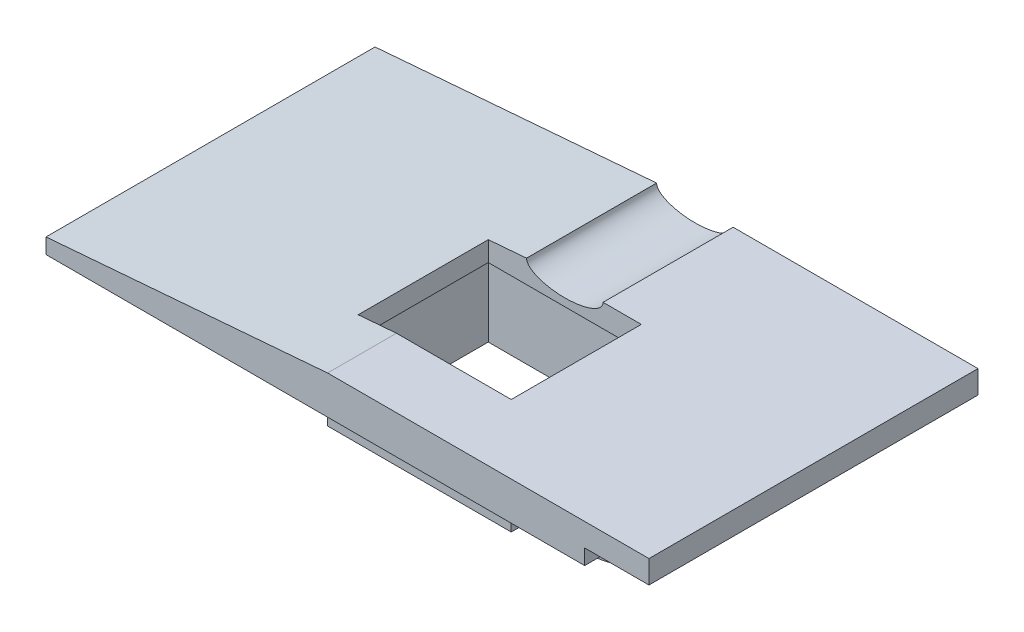
ISO-10303-21;
HEADER;
FILE_DESCRIPTION(('STEP AP214'),'2;1');
FILE_NAME('part.step','',(''),(''),'','','');
FILE_SCHEMA(('AUTOMOTIVE_DESIGN { 1 0 10303 214 1 1 1 1 }'));
ENDSEC;
DATA;
#1=APPLICATION_CONTEXT('core data for automotive mechanical design processes');
#2=APPLICATION_PROTOCOL_DEFINITION('international standard','automotive_design',2000,#1);
#3=PRODUCT_CONTEXT('',#1,'mechanical');
#4=PRODUCT('Part','Part','',(#3));
#5=PRODUCT_RELATED_PRODUCT_CATEGORY('part','',(#4));
#6=PRODUCT_DEFINITION_FORMATION('','',#4);
#7=PRODUCT_DEFINITION_CONTEXT('part definition',#1,'design');
#8=PRODUCT_DEFINITION('design','',#6,#7);
#9=PRODUCT_DEFINITION_SHAPE('','',#8);
#10=(LENGTH_UNIT() NAMED_UNIT(*) SI_UNIT(.MILLI.,.METRE.));
#11=(NAMED_UNIT(*) PLANE_ANGLE_UNIT() SI_UNIT($,.RADIAN.));
#12=(NAMED_UNIT(*) SI_UNIT($,.STERADIAN.) SOLID_ANGLE_UNIT());
#13=UNCERTAINTY_MEASURE_WITH_UNIT(LENGTH_MEASURE(1.E-05),#10,'distance_accuracy_value','');
#14=(GEOMETRIC_REPRESENTATION_CONTEXT(3) GLOBAL_UNCERTAINTY_ASSIGNED_CONTEXT((#13)) GLOBAL_UNIT_ASSIGNED_CONTEXT((#10,
#11,#12)) REPRESENTATION_CONTEXT('',''));
#15=CARTESIAN_POINT('',(0.,0.,0.));
#16=DIRECTION('',(0.,0.,1.));
#17=DIRECTION('',(1.,0.,0.));
#18=AXIS2_PLACEMENT_3D('',#15,#16,#17);
#19=CARTESIAN_POINT('',(0.661018711018712,-1.33076923076924,7.5));
#20=DIRECTION('',(-1.,0.,0.));
#21=DIRECTION('',(0.,0.,1.));
#22=AXIS2_PLACEMENT_3D('',#19,#20,#21);
#23=PLANE('',#22);
#24=DIRECTION('',(0.,1.,0.));
#25=VECTOR('',#24,1.);
#26=CARTESIAN_POINT('',(0.661018711018713,-2.33076923076924,13.2908326913196));
#27=LINE('',#26,#25);
#28=CARTESIAN_POINT('',(0.661018711018713,2.66923076923077,13.2908326913196));
#29=VERTEX_POINT('',#28);
#30=CARTESIAN_POINT('',(0.661018711018713,-1.33076923076924,13.2908326913196));
#31=VERTEX_POINT('',#30);
#32=EDGE_CURVE('E57',#29,#31,#27,.F.);
#33=ORIENTED_EDGE('',*,*,#32,.F.);
#34=DIRECTION('',(0.,0.,1.));
#35=VECTOR('',#34,1.);
#36=CARTESIAN_POINT('',(0.661018711018712,2.66923076923077,7.5));
#37=LINE('',#36,#35);
#38=CARTESIAN_POINT('',(0.661018711018713,2.66923076923077,18.));
#39=VERTEX_POINT('',#38);
#40=EDGE_CURVE('E209',#29,#39,#37,.T.);
#41=ORIENTED_EDGE('',*,*,#40,.T.);
#42=DIRECTION('',(0.,1.,0.));
#43=VECTOR('',#42,1.);
#44=CARTESIAN_POINT('',(0.661018711018714,-1.33076923076924,18.));
#45=LINE('',#44,#43);
#46=CARTESIAN_POINT('',(0.661018711018714,-1.33076923076924,18.));
#47=VERTEX_POINT('',#46);
#48=EDGE_CURVE('E232',#47,#39,#45,.T.);
#49=ORIENTED_EDGE('',*,*,#48,.F.);
#50=DIRECTION('',(0.,0.,1.));
#51=VECTOR('',#50,1.);
#52=CARTESIAN_POINT('',(0.661018711018712,-1.33076923076924,7.5));
#53=LINE('',#52,#51);
#54=EDGE_CURVE('E211',#31,#47,#53,.T.);
#55=ORIENTED_EDGE('',*,*,#54,.F.);
#56=EDGE_LOOP('',(#33,#41,#49,#55));
#57=FACE_BOUND('',#56,.T.);
#58=ADVANCED_FACE('F41',(#57),#23,.F.);
#59=DIRECTION('',(0.,1.,0.));
#60=VECTOR('',#59,1.);
#61=CARTESIAN_POINT('',(0.661018711018713,-2.33076923076924,12.2091673086804));
#62=LINE('',#61,#60);
#63=CARTESIAN_POINT('',(0.661018711018713,-1.33076923076924,12.2091673086804));
#64=VERTEX_POINT('',#63);
#65=CARTESIAN_POINT('',(0.661018711018712,2.66923076923077,12.2091673086804));
#66=VERTEX_POINT('',#65);
#67=EDGE_CURVE('E197',#64,#66,#62,.T.);
#68=ORIENTED_EDGE('',*,*,#67,.F.);
#69=CARTESIAN_POINT('',(0.661018711018712,-1.33076923076924,7.5));
#70=VERTEX_POINT('',#69);
#71=EDGE_CURVE('E236',#70,#64,#53,.T.);
#72=ORIENTED_EDGE('',*,*,#71,.F.);
#73=DIRECTION('',(0.,1.,0.));
#74=VECTOR('',#73,1.);
#75=CARTESIAN_POINT('',(0.661018711018712,-1.33076923076924,7.5));
#76=LINE('',#75,#74);
#77=CARTESIAN_POINT('',(0.661018711018712,2.66923076923077,7.5));
#78=VERTEX_POINT('',#77);
#79=EDGE_CURVE('E235',#70,#78,#76,.T.);
#80=ORIENTED_EDGE('',*,*,#79,.T.);
#81=EDGE_CURVE('E221',#78,#66,#37,.T.);
#82=ORIENTED_EDGE('',*,*,#81,.T.);
#83=EDGE_LOOP('',(#68,#72,#80,#82));
#84=FACE_BOUND('',#83,.T.);
#85=ADVANCED_FACE('F322',(#84),#23,.F.);
#86=CARTESIAN_POINT('',(-5.33898128898128,2.66923076923076,8.5));
#87=DIRECTION('',(0.,0.,-1.));
#88=DIRECTION('',(-1.,0.,0.));
#89=AXIS2_PLACEMENT_3D('',#86,#87,#88);
#90=PLANE('',#89);
#91=DIRECTION('',(-1.,0.,0.));
#92=VECTOR('',#91,1.);
#93=CARTESIAN_POINT('',(-5.33898128898128,3.66923076923076,8.5));
#94=LINE('',#93,#92);
#95=CARTESIAN_POINT('',(-0.338981288981282,3.66923076923077,8.5));
#96=VERTEX_POINT('',#95);
#97=CARTESIAN_POINT('',(-10.3389812889813,3.66923076923076,8.5));
#98=VERTEX_POINT('',#97);
#99=EDGE_CURVE('E64',#96,#98,#94,.T.);
#100=ORIENTED_EDGE('',*,*,#99,.F.);
#101=DIRECTION('',(0.,1.,0.));
#102=VECTOR('',#101,1.);
#103=CARTESIAN_POINT('',(-0.338981288981282,2.66923076923076,8.5));
#104=LINE('',#103,#102);
#105=CARTESIAN_POINT('',(-0.338981288981282,5.16923076923077,8.5));
#106=VERTEX_POINT('',#105);
#107=EDGE_CURVE('E258',#96,#106,#104,.T.);
#108=ORIENTED_EDGE('',*,*,#107,.T.);
#109=DIRECTION('',(-1.,0.,0.));
#110=VECTOR('',#109,1.);
#111=CARTESIAN_POINT('',(-5.33898128898128,5.16923076923077,8.5));
#112=LINE('',#111,#110);
#113=CARTESIAN_POINT('',(-2.83898128898128,5.16923076923077,8.5));
#114=VERTEX_POINT('',#113);
#115=EDGE_CURVE('E246',#106,#114,#112,.T.);
#116=ORIENTED_EDGE('',*,*,#115,.T.);
#117=CARTESIAN_POINT('',(-5.33898128898128,5.16923076923077,8.5));
#118=DIRECTION('',(0.,0.,-1.));
#119=DIRECTION('',(-1.,0.,0.));
#120=AXIS2_PLACEMENT_3D('',#117,#118,#119);
#121=ELLIPSE('',#120,2.5,1.);
#122=CARTESIAN_POINT('',(-7.83898128898129,5.16923076923077,8.5));
#123=VERTEX_POINT('',#122);
#124=EDGE_CURVE('E365',#114,#123,#121,.T.);
#125=ORIENTED_EDGE('',*,*,#124,.T.);
#126=DIRECTION('',(-0.996693574295642,-0.08125219355671,0.));
#127=VECTOR('',#126,1.);
#128=CARTESIAN_POINT('',(-26.2389812889813,3.66923076923077,8.5));
#129=LINE('',#128,#127);
#130=CARTESIAN_POINT('',(-10.3389812889813,4.96542642140468,8.5));
#131=VERTEX_POINT('',#130);
#132=EDGE_CURVE('E261',#123,#131,#129,.T.);
#133=ORIENTED_EDGE('',*,*,#132,.T.);
#134=DIRECTION('',(0.,1.,0.));
#135=VECTOR('',#134,1.);
#136=CARTESIAN_POINT('',(-10.3389812889813,2.66923076923076,8.5));
#137=LINE('',#136,#135);
#138=EDGE_CURVE('E257',#98,#131,#137,.T.);
#139=ORIENTED_EDGE('',*,*,#138,.F.);
#140=EDGE_LOOP('',(#100,#108,#116,#125,#133,#139));
#141=FACE_BOUND('',#140,.T.);
#142=ADVANCED_FACE('F287',(#141),#90,.F.);
#143=CARTESIAN_POINT('',(-0.338981288981282,2.66923076923076,17.));
#144=DIRECTION('',(1.,0.,0.));
#145=DIRECTION('',(0.,0.,-1.));
#146=AXIS2_PLACEMENT_3D('',#143,#144,#145);
#147=PLANE('',#146);
#148=DIRECTION('',(0.,0.,-1.));
#149=VECTOR('',#148,1.);
#150=CARTESIAN_POINT('',(-0.338981288981282,3.66923076923077,17.));
#151=LINE('',#150,#149);
#152=CARTESIAN_POINT('',(-0.338981288981282,3.66923076923076,17.));
#153=VERTEX_POINT('',#152);
#154=EDGE_CURVE('E490',#153,#96,#151,.T.);
#155=ORIENTED_EDGE('',*,*,#154,.F.);
#156=DIRECTION('',(0.,1.,0.));
#157=VECTOR('',#156,1.);
#158=CARTESIAN_POINT('',(-0.338981288981282,2.66923076923076,17.));
#159=LINE('',#158,#157);
#160=CARTESIAN_POINT('',(-0.338981288981282,5.16923076923077,17.));
#161=VERTEX_POINT('',#160);
#162=EDGE_CURVE('E262',#153,#161,#159,.T.);
#163=ORIENTED_EDGE('',*,*,#162,.T.);
#164=DIRECTION('',(0.,0.,-1.));
#165=VECTOR('',#164,1.);
#166=CARTESIAN_POINT('',(-0.338981288981282,5.16923076923077,17.));
#167=LINE('',#166,#165);
#168=EDGE_CURVE('E253',#161,#106,#167,.T.);
#169=ORIENTED_EDGE('',*,*,#168,.T.);
#170=ORIENTED_EDGE('',*,*,#107,.F.);
#171=EDGE_LOOP('',(#155,#163,#169,#170));
#172=FACE_BOUND('',#171,.T.);
#173=ADVANCED_FACE('F343',(#172),#147,.F.);
#174=CARTESIAN_POINT('',(-10.3389812889813,2.66923076923076,17.));
#175=DIRECTION('',(0.,0.,1.));
#176=DIRECTION('',(1.,0.,0.));
#177=AXIS2_PLACEMENT_3D('',#174,#175,#176);
#178=PLANE('',#177);
#179=DIRECTION('',(1.,0.,0.));
#180=VECTOR('',#179,1.);
#181=CARTESIAN_POINT('',(-10.3389812889813,3.66923076923076,17.));
#182=LINE('',#181,#180);
#183=CARTESIAN_POINT('',(-10.3389812889813,3.66923076923076,17.));
#184=VERTEX_POINT('',#183);
#185=EDGE_CURVE('E487',#184,#153,#182,.T.);
#186=ORIENTED_EDGE('',*,*,#185,.F.);
#187=DIRECTION('',(0.,1.,0.));
#188=VECTOR('',#187,1.);
#189=CARTESIAN_POINT('',(-10.3389812889813,2.66923076923076,17.));
#190=LINE('',#189,#188);
#191=CARTESIAN_POINT('',(-10.3389812889813,4.96542642140468,17.));
#192=VERTEX_POINT('',#191);
#193=EDGE_CURVE('E265',#184,#192,#190,.T.);
#194=ORIENTED_EDGE('',*,*,#193,.T.);
#195=DIRECTION('',(0.996693574295642,0.08125219355671,0.));
#196=VECTOR('',#195,1.);
#197=CARTESIAN_POINT('',(-26.2389812889813,3.66923076923077,17.));
#198=LINE('',#197,#196);
#199=CARTESIAN_POINT('',(-7.83898128898129,5.16923076923077,17.));
#200=VERTEX_POINT('',#199);
#201=EDGE_CURVE('E359',#192,#200,#198,.T.);
#202=ORIENTED_EDGE('',*,*,#201,.T.);
#203=DIRECTION('',(1.,0.,0.));
#204=VECTOR('',#203,1.);
#205=CARTESIAN_POINT('',(-10.3389812889813,5.16923076923077,17.));
#206=LINE('',#205,#204);
#207=EDGE_CURVE('E249',#200,#161,#206,.T.);
#208=ORIENTED_EDGE('',*,*,#207,.T.);
#209=ORIENTED_EDGE('',*,*,#162,.F.);
#210=EDGE_LOOP('',(#186,#194,#202,#208,#209));
#211=FACE_BOUND('',#210,.T.);
#212=ADVANCED_FACE('F346',(#211),#178,.F.);
#213=CARTESIAN_POINT('',(-10.3389812889813,2.66923076923076,8.5));
#214=DIRECTION('',(-1.,0.,0.));
#215=DIRECTION('',(0.,0.,1.));
#216=AXIS2_PLACEMENT_3D('',#213,#214,#215);
#217=PLANE('',#216);
#218=DIRECTION('',(0.,0.,1.));
#219=VECTOR('',#218,1.);
#220=CARTESIAN_POINT('',(-10.3389812889813,3.66923076923076,8.5));
#221=LINE('',#220,#219);
#222=EDGE_CURVE('E50',#98,#184,#221,.T.);
#223=ORIENTED_EDGE('',*,*,#222,.F.);
#224=ORIENTED_EDGE('',*,*,#138,.T.);
#225=DIRECTION('',(0.,0.,1.));
#226=VECTOR('',#225,1.);
#227=CARTESIAN_POINT('',(-10.3389812889813,4.96542642140468,21.5));
#228=LINE('',#227,#226);
#229=EDGE_CURVE('E368',#131,#192,#228,.T.);
#230=ORIENTED_EDGE('',*,*,#229,.T.);
#231=ORIENTED_EDGE('',*,*,#193,.F.);
#232=EDGE_LOOP('',(#223,#224,#230,#231));
#233=FACE_BOUND('',#232,.T.);
#234=ADVANCED_FACE('F299',(#233),#217,.F.);
#235=CARTESIAN_POINT('',(8.96101871101872,2.66923076923077,21.5));
#236=DIRECTION('',(0.,-1.,0.));
#237=DIRECTION('',(1.,0.,0.));
#238=AXIS2_PLACEMENT_3D('',#235,#236,#237);
#239=PLANE('',#238);
#240=CARTESIAN_POINT('',(-14.2489812889813,2.66923076923076,12.75));
#241=DIRECTION('',(0.,-1.,0.));
#242=DIRECTION('',(1.,0.,0.));
#243=AXIS2_PLACEMENT_3D('',#240,#241,#242);
#244=CIRCLE('',#243,2.9);
#245=CARTESIAN_POINT('',(-11.3489812889813,2.66923076923076,12.75));
#246=VERTEX_POINT('',#245);
#247=EDGE_CURVE('E596',#246,#246,#244,.T.);
#248=ORIENTED_EDGE('',*,*,#247,.F.);
#249=EDGE_LOOP('',(#248));
#250=FACE_BOUND('',#249,.T.);
#251=DIRECTION('',(-1.,0.,0.));
#252=VECTOR('',#251,1.);
#253=CARTESIAN_POINT('',(8.96101871101872,2.66923076923077,0.));
#254=LINE('',#253,#252);
#255=CARTESIAN_POINT('',(8.96101871101872,2.66923076923077,0.));
#256=VERTEX_POINT('',#255);
#257=CARTESIAN_POINT('',(-26.2389812889813,2.66923076923076,0.));
#258=VERTEX_POINT('',#257);
#259=EDGE_CURVE('E408',#256,#258,#254,.T.);
#260=ORIENTED_EDGE('',*,*,#259,.F.);
#261=DIRECTION('',(0.,0.,-1.));
#262=VECTOR('',#261,1.);
#263=CARTESIAN_POINT('',(8.96101871101872,2.66923076923077,21.5));
#264=LINE('',#263,#262);
#265=CARTESIAN_POINT('',(8.96101871101872,2.66923076923077,21.5));
#266=VERTEX_POINT('',#265);
#267=EDGE_CURVE('E376',#266,#256,#264,.T.);
#268=ORIENTED_EDGE('',*,*,#267,.F.);
#269=DIRECTION('',(-1.,0.,0.));
#270=VECTOR('',#269,1.);
#271=CARTESIAN_POINT('',(8.96101871101872,2.66923076923077,21.5));
#272=LINE('',#271,#270);
#273=CARTESIAN_POINT('',(-26.2389812889813,2.66923076923076,21.5));
#274=VERTEX_POINT('',#273);
#275=EDGE_CURVE('E436',#266,#274,#272,.T.);
#276=ORIENTED_EDGE('',*,*,#275,.T.);
#277=DIRECTION('',(0.,0.,-1.));
#278=VECTOR('',#277,1.);
#279=CARTESIAN_POINT('',(-26.2389812889813,2.66923076923076,21.5));
#280=LINE('',#279,#278);
#281=EDGE_CURVE('E371',#274,#258,#280,.T.);
#282=ORIENTED_EDGE('',*,*,#281,.T.);
#283=EDGE_LOOP('',(#260,#268,#276,#282));
#284=FACE_BOUND('',#283,.T.);
#285=ORIENTED_EDGE('',*,*,#40,.F.);
#286=CARTESIAN_POINT('',(3.56101871101871,2.66923076923077,12.75));
#287=DIRECTION('',(0.,-1.,0.));
#288=DIRECTION('',(1.,0.,0.));
#289=AXIS2_PLACEMENT_3D('',#286,#287,#288);
#290=CIRCLE('',#289,2.95);
#291=EDGE_CURVE('E194',#66,#29,#290,.T.);
#292=ORIENTED_EDGE('',*,*,#291,.F.);
#293=ORIENTED_EDGE('',*,*,#81,.F.);
#294=DIRECTION('',(1.,0.,0.));
#295=VECTOR('',#294,1.);
#296=CARTESIAN_POINT('',(-11.3389812889813,2.66923076923076,7.5));
#297=LINE('',#296,#295);
#298=CARTESIAN_POINT('',(-11.3389812889813,2.66923076923076,7.5));
#299=VERTEX_POINT('',#298);
#300=EDGE_CURVE('E222',#299,#78,#297,.T.);
#301=ORIENTED_EDGE('',*,*,#300,.F.);
#302=DIRECTION('',(0.,0.,-1.));
#303=VECTOR('',#302,1.);
#304=CARTESIAN_POINT('',(-11.3389812889813,2.66923076923076,18.));
#305=LINE('',#304,#303);
#306=CARTESIAN_POINT('',(-11.3389812889813,2.66923076923076,18.));
#307=VERTEX_POINT('',#306);
#308=EDGE_CURVE('E228',#307,#299,#305,.T.);
#309=ORIENTED_EDGE('',*,*,#308,.F.);
#310=DIRECTION('',(-1.,0.,0.));
#311=VECTOR('',#310,1.);
#312=CARTESIAN_POINT('',(0.661018711018713,2.66923076923077,18.));
#313=LINE('',#312,#311);
#314=EDGE_CURVE('E219',#39,#307,#313,.T.);
#315=ORIENTED_EDGE('',*,*,#314,.F.);
#316=EDGE_LOOP('',(#285,#292,#293,#301,#309,#315));
#317=FACE_BOUND('',#316,.T.);
#318=ADVANCED_FACE('F216',(#250,#284,#317),#239,.T.);
#319=CARTESIAN_POINT('',(-26.2389812889813,2.66923076923076,21.5));
#320=DIRECTION('',(-1.,0.,0.));
#321=DIRECTION('',(0.,0.,1.));
#322=AXIS2_PLACEMENT_3D('',#319,#320,#321);
#323=PLANE('',#322);
#324=DIRECTION('',(0.,1.,0.));
#325=VECTOR('',#324,1.);
#326=CARTESIAN_POINT('',(-26.2389812889813,2.66923076923076,0.));
#327=LINE('',#326,#325);
#328=CARTESIAN_POINT('',(-26.2389812889813,3.66923076923077,0.));
#329=VERTEX_POINT('',#328);
#330=EDGE_CURVE('E432',#258,#329,#327,.T.);
#331=ORIENTED_EDGE('',*,*,#330,.F.);
#332=ORIENTED_EDGE('',*,*,#281,.F.);
#333=DIRECTION('',(0.,1.,0.));
#334=VECTOR('',#333,1.);
#335=CARTESIAN_POINT('',(-26.2389812889813,2.66923076923076,21.5));
#336=LINE('',#335,#334);
#337=CARTESIAN_POINT('',(-26.2389812889813,3.66923076923077,21.5));
#338=VERTEX_POINT('',#337);
#339=EDGE_CURVE('E412',#274,#338,#336,.T.);
#340=ORIENTED_EDGE('',*,*,#339,.T.);
#341=DIRECTION('',(0.,0.,-1.));
#342=VECTOR('',#341,1.);
#343=CARTESIAN_POINT('',(-26.2389812889813,3.66923076923077,21.5));
#344=LINE('',#343,#342);
#345=EDGE_CURVE('E394',#338,#329,#344,.T.);
#346=ORIENTED_EDGE('',*,*,#345,.T.);
#347=EDGE_LOOP('',(#331,#332,#340,#346));
#348=FACE_BOUND('',#347,.T.);
#349=ADVANCED_FACE('F43',(#348),#323,.T.);
#350=CARTESIAN_POINT('',(8.96101871101872,3.66923076923077,21.5));
#351=DIRECTION('',(1.,0.,0.));
#352=DIRECTION('',(0.,0.,-1.));
#353=AXIS2_PLACEMENT_3D('',#350,#351,#352);
#354=PLANE('',#353);
#355=DIRECTION('',(0.,-1.,0.));
#356=VECTOR('',#355,1.);
#357=CARTESIAN_POINT('',(8.96101871101872,3.66923076923077,0.));
#358=LINE('',#357,#356);
#359=CARTESIAN_POINT('',(8.96101871101872,3.66923076923077,0.));
#360=VERTEX_POINT('',#359);
#361=EDGE_CURVE('E413',#360,#256,#358,.T.);
#362=ORIENTED_EDGE('',*,*,#361,.F.);
#363=DIRECTION('',(0.,0.,-1.));
#364=VECTOR('',#363,1.);
#365=CARTESIAN_POINT('',(8.96101871101872,3.66923076923077,21.5));
#366=LINE('',#365,#364);
#367=CARTESIAN_POINT('',(8.96101871101872,3.66923076923077,21.5));
#368=VERTEX_POINT('',#367);
#369=EDGE_CURVE('E403',#368,#360,#366,.T.);
#370=ORIENTED_EDGE('',*,*,#369,.F.);
#371=DIRECTION('',(0.,-1.,0.));
#372=VECTOR('',#371,1.);
#373=CARTESIAN_POINT('',(8.96101871101872,3.66923076923077,21.5));
#374=LINE('',#373,#372);
#375=EDGE_CURVE('E440',#368,#266,#374,.T.);
#376=ORIENTED_EDGE('',*,*,#375,.T.);
#377=ORIENTED_EDGE('',*,*,#267,.T.);
#378=EDGE_LOOP('',(#362,#370,#376,#377));
#379=FACE_BOUND('',#378,.T.);
#380=ADVANCED_FACE('F301',(#379),#354,.T.);
#381=CARTESIAN_POINT('',(13.1610187110187,3.66923076923077,21.5));
#382=DIRECTION('',(0.,-1.,0.));
#383=DIRECTION('',(0.,0.,-1.));
#384=AXIS2_PLACEMENT_3D('',#381,#382,#383);
#385=PLANE('',#384);
#386=DIRECTION('',(-1.,0.,0.));
#387=VECTOR('',#386,1.);
#388=CARTESIAN_POINT('',(13.1610187110187,3.66923076923077,0.));
#389=LINE('',#388,#387);
#390=CARTESIAN_POINT('',(13.1610187110187,3.66923076923077,0.));
#391=VERTEX_POINT('',#390);
#392=EDGE_CURVE('E417',#391,#360,#389,.T.);
#393=ORIENTED_EDGE('',*,*,#392,.F.);
#394=DIRECTION('',(0.,0.,-1.));
#395=VECTOR('',#394,1.);
#396=CARTESIAN_POINT('',(13.1610187110187,3.66923076923077,21.5));
#397=LINE('',#396,#395);
#398=CARTESIAN_POINT('',(13.1610187110187,3.66923076923077,21.5));
#399=VERTEX_POINT('',#398);
#400=EDGE_CURVE('E400',#399,#391,#397,.T.);
#401=ORIENTED_EDGE('',*,*,#400,.F.);
#402=DIRECTION('',(-1.,0.,0.));
#403=VECTOR('',#402,1.);
#404=CARTESIAN_POINT('',(13.1610187110187,3.66923076923077,21.5));
#405=LINE('',#404,#403);
#406=EDGE_CURVE('E444',#399,#368,#405,.T.);
#407=ORIENTED_EDGE('',*,*,#406,.T.);
#408=ORIENTED_EDGE('',*,*,#369,.T.);
#409=EDGE_LOOP('',(#393,#401,#407,#408));
#410=FACE_BOUND('',#409,.T.);
#411=ADVANCED_FACE('F304',(#410),#385,.T.);
#412=CARTESIAN_POINT('',(13.1610187110187,5.16923076923077,21.5));
#413=DIRECTION('',(1.,0.,0.));
#414=DIRECTION('',(0.,0.,-1.));
#415=AXIS2_PLACEMENT_3D('',#412,#413,#414);
#416=PLANE('',#415);
#417=DIRECTION('',(0.,-1.,0.));
#418=VECTOR('',#417,1.);
#419=CARTESIAN_POINT('',(13.1610187110187,5.16923076923077,0.));
#420=LINE('',#419,#418);
#421=CARTESIAN_POINT('',(13.1610187110187,5.16923076923077,0.));
#422=VERTEX_POINT('',#421);
#423=EDGE_CURVE('E421',#422,#391,#420,.T.);
#424=ORIENTED_EDGE('',*,*,#423,.F.);
#425=DIRECTION('',(0.,0.,-1.));
#426=VECTOR('',#425,1.);
#427=CARTESIAN_POINT('',(13.1610187110187,5.16923076923077,21.5));
#428=LINE('',#427,#426);
#429=CARTESIAN_POINT('',(13.1610187110187,5.16923076923077,21.5));
#430=VERTEX_POINT('',#429);
#431=EDGE_CURVE('E393',#430,#422,#428,.T.);
#432=ORIENTED_EDGE('',*,*,#431,.F.);
#433=DIRECTION('',(0.,-1.,0.));
#434=VECTOR('',#433,1.);
#435=CARTESIAN_POINT('',(13.1610187110187,5.16923076923077,21.5));
#436=LINE('',#435,#434);
#437=EDGE_CURVE('E448',#430,#399,#436,.T.);
#438=ORIENTED_EDGE('',*,*,#437,.T.);
#439=ORIENTED_EDGE('',*,*,#400,.T.);
#440=EDGE_LOOP('',(#424,#432,#438,#439));
#441=FACE_BOUND('',#440,.T.);
#442=ADVANCED_FACE('F308',(#441),#416,.T.);
#443=CARTESIAN_POINT('',(-7.83898128898129,5.16923076923077,21.5));
#444=DIRECTION('',(0.,1.,0.));
#445=DIRECTION('',(0.,0.,1.));
#446=AXIS2_PLACEMENT_3D('',#443,#444,#445);
#447=PLANE('',#446);
#448=ORIENTED_EDGE('',*,*,#207,.F.);
#449=DIRECTION('',(0.,0.,-1.));
#450=VECTOR('',#449,1.);
#451=CARTESIAN_POINT('',(-7.83898128898129,5.16923076923077,21.5));
#452=LINE('',#451,#450);
#453=CARTESIAN_POINT('',(-7.83898128898129,5.16923076923077,21.5));
#454=VERTEX_POINT('',#453);
#455=EDGE_CURVE('E389',#454,#200,#452,.T.);
#456=ORIENTED_EDGE('',*,*,#455,.F.);
#457=DIRECTION('',(1.,0.,0.));
#458=VECTOR('',#457,1.);
#459=CARTESIAN_POINT('',(-7.83898128898129,5.16923076923077,21.5));
#460=LINE('',#459,#458);
#461=EDGE_CURVE('E452',#454,#430,#460,.T.);
#462=ORIENTED_EDGE('',*,*,#461,.T.);
#463=ORIENTED_EDGE('',*,*,#431,.T.);
#464=DIRECTION('',(1.,0.,0.));
#465=VECTOR('',#464,1.);
#466=CARTESIAN_POINT('',(-7.83898128898129,5.16923076923077,0.));
#467=LINE('',#466,#465);
#468=CARTESIAN_POINT('',(-2.83898128898128,5.16923076923077,0.));
#469=VERTEX_POINT('',#468);
#470=EDGE_CURVE('E425',#469,#422,#467,.T.);
#471=ORIENTED_EDGE('',*,*,#470,.F.);
#472=DIRECTION('',(0.,0.,-1.));
#473=VECTOR('',#472,1.);
#474=CARTESIAN_POINT('',(-2.83898128898128,5.16923076923077,8.5));
#475=LINE('',#474,#473);
#476=EDGE_CURVE('E388',#114,#469,#475,.T.);
#477=ORIENTED_EDGE('',*,*,#476,.F.);
#478=ORIENTED_EDGE('',*,*,#115,.F.);
#479=ORIENTED_EDGE('',*,*,#168,.F.);
#480=EDGE_LOOP('',(#448,#456,#462,#463,#471,#477,#478,#479));
#481=FACE_BOUND('',#480,.T.);
#482=ADVANCED_FACE('F312',(#481),#447,.T.);
#483=CARTESIAN_POINT('',(-26.2389812889813,3.66923076923077,21.5));
#484=DIRECTION('',(-0.08125219355671,0.996693574295642,0.));
#485=DIRECTION('',(-0.996693574295642,-0.08125219355671,0.));
#486=AXIS2_PLACEMENT_3D('',#483,#484,#485);
#487=PLANE('',#486);
#488=ORIENTED_EDGE('',*,*,#201,.F.);
#489=ORIENTED_EDGE('',*,*,#229,.F.);
#490=ORIENTED_EDGE('',*,*,#132,.F.);
#491=DIRECTION('',(0.,0.,-1.));
#492=VECTOR('',#491,1.);
#493=CARTESIAN_POINT('',(-7.83898128898129,5.16923076923077,8.5));
#494=LINE('',#493,#492);
#495=CARTESIAN_POINT('',(-7.83898128898129,5.16923076923077,0.));
#496=VERTEX_POINT('',#495);
#497=EDGE_CURVE('E383',#123,#496,#494,.T.);
#498=ORIENTED_EDGE('',*,*,#497,.T.);
#499=DIRECTION('',(0.996693574295642,0.08125219355671,0.));
#500=VECTOR('',#499,1.);
#501=CARTESIAN_POINT('',(-26.2389812889813,3.66923076923077,0.));
#502=LINE('',#501,#500);
#503=EDGE_CURVE('E428',#329,#496,#502,.T.);
#504=ORIENTED_EDGE('',*,*,#503,.F.);
#505=ORIENTED_EDGE('',*,*,#345,.F.);
#506=DIRECTION('',(0.996693574295642,0.08125219355671,0.));
#507=VECTOR('',#506,1.);
#508=CARTESIAN_POINT('',(-26.2389812889813,3.66923076923077,21.5));
#509=LINE('',#508,#507);
#510=EDGE_CURVE('E456',#338,#454,#509,.T.);
#511=ORIENTED_EDGE('',*,*,#510,.T.);
#512=ORIENTED_EDGE('',*,*,#455,.T.);
#513=EDGE_LOOP('',(#488,#489,#490,#498,#504,#505,#511,#512));
#514=FACE_BOUND('',#513,.T.);
#515=ADVANCED_FACE('F292',(#514),#487,.T.);
#516=CARTESIAN_POINT('',(0.,0.,21.5));
#517=DIRECTION('',(0.,0.,-1.));
#518=DIRECTION('',(-1.,0.,0.));
#519=AXIS2_PLACEMENT_3D('',#516,#517,#518);
#520=PLANE('',#519);
#521=ORIENTED_EDGE('',*,*,#339,.F.);
#522=ORIENTED_EDGE('',*,*,#275,.F.);
#523=ORIENTED_EDGE('',*,*,#375,.F.);
#524=ORIENTED_EDGE('',*,*,#406,.F.);
#525=ORIENTED_EDGE('',*,*,#437,.F.);
#526=ORIENTED_EDGE('',*,*,#461,.F.);
#527=ORIENTED_EDGE('',*,*,#510,.F.);
#528=EDGE_LOOP('',(#521,#522,#523,#524,#525,#526,#527));
#529=FACE_BOUND('',#528,.T.);
#530=ADVANCED_FACE('F289',(#529),#520,.F.);
#531=CARTESIAN_POINT('',(0.,0.,0.));
#532=DIRECTION('',(0.,0.,-1.));
#533=DIRECTION('',(-1.,0.,0.));
#534=AXIS2_PLACEMENT_3D('',#531,#532,#533);
#535=PLANE('',#534);
#536=CARTESIAN_POINT('',(-5.33898128898128,5.16923076923077,0.));
#537=DIRECTION('',(0.,0.,-1.));
#538=DIRECTION('',(1.,0.,0.));
#539=AXIS2_PLACEMENT_3D('',#536,#537,#538);
#540=ELLIPSE('',#539,2.5,1.);
#541=EDGE_CURVE('E273',#469,#496,#540,.T.);
#542=ORIENTED_EDGE('',*,*,#541,.F.);
#543=ORIENTED_EDGE('',*,*,#470,.T.);
#544=ORIENTED_EDGE('',*,*,#423,.T.);
#545=ORIENTED_EDGE('',*,*,#392,.T.);
#546=ORIENTED_EDGE('',*,*,#361,.T.);
#547=ORIENTED_EDGE('',*,*,#259,.T.);
#548=ORIENTED_EDGE('',*,*,#330,.T.);
#549=ORIENTED_EDGE('',*,*,#503,.T.);
#550=EDGE_LOOP('',(#542,#543,#544,#545,#546,#547,#548,#549));
#551=FACE_BOUND('',#550,.T.);
#552=ADVANCED_FACE('F285',(#551),#535,.T.);
#553=CARTESIAN_POINT('',(-5.33898128898128,5.16923076923077,8.5));
#554=DIRECTION('',(0.,0.,-1.));
#555=DIRECTION('',(1.,0.,0.));
#556=AXIS2_PLACEMENT_3D('',#553,#554,#555);
#557=ELLIPSE('',#556,2.5,1.);
#558=DIRECTION('',(0.,0.,-1.));
#559=VECTOR('',#558,1.);
#560=SURFACE_OF_LINEAR_EXTRUSION('',#557,#559);
#561=ORIENTED_EDGE('',*,*,#541,.T.);
#562=ORIENTED_EDGE('',*,*,#497,.F.);
#563=ORIENTED_EDGE('',*,*,#124,.F.);
#564=ORIENTED_EDGE('',*,*,#476,.T.);
#565=EDGE_LOOP('',(#561,#562,#563,#564));
#566=FACE_BOUND('',#565,.T.);
#567=ADVANCED_FACE('F280',(#566),#560,.F.);
#568=CARTESIAN_POINT('',(0.661018711018714,-1.33076923076924,18.));
#569=DIRECTION('',(0.,0.,-1.));
#570=DIRECTION('',(-1.,0.,0.));
#571=AXIS2_PLACEMENT_3D('',#568,#569,#570);
#572=PLANE('',#571);
#573=ORIENTED_EDGE('',*,*,#314,.T.);
#574=DIRECTION('',(0.,1.,0.));
#575=VECTOR('',#574,1.);
#576=CARTESIAN_POINT('',(-11.3389812889813,-1.33076923076924,18.));
#577=LINE('',#576,#575);
#578=CARTESIAN_POINT('',(-11.3389812889813,-1.33076923076924,18.));
#579=VERTEX_POINT('',#578);
#580=EDGE_CURVE('E243',#579,#307,#577,.T.);
#581=ORIENTED_EDGE('',*,*,#580,.F.);
#582=DIRECTION('',(-1.,0.,0.));
#583=VECTOR('',#582,1.);
#584=CARTESIAN_POINT('',(0.661018711018714,-1.33076923076924,18.));
#585=LINE('',#584,#583);
#586=EDGE_CURVE('E226',#47,#579,#585,.T.);
#587=ORIENTED_EDGE('',*,*,#586,.F.);
#588=ORIENTED_EDGE('',*,*,#48,.T.);
#589=EDGE_LOOP('',(#573,#581,#587,#588));
#590=FACE_BOUND('',#589,.T.);
#591=ADVANCED_FACE('F284',(#590),#572,.F.);
#592=CARTESIAN_POINT('',(-11.3389812889813,-1.33076923076924,18.));
#593=DIRECTION('',(1.,0.,0.));
#594=DIRECTION('',(0.,0.,-1.));
#595=AXIS2_PLACEMENT_3D('',#592,#593,#594);
#596=PLANE('',#595);
#597=ORIENTED_EDGE('',*,*,#308,.T.);
#598=DIRECTION('',(0.,1.,0.));
#599=VECTOR('',#598,1.);
#600=CARTESIAN_POINT('',(-11.3389812889813,-1.33076923076924,7.5));
#601=LINE('',#600,#599);
#602=CARTESIAN_POINT('',(-11.3389812889813,-1.33076923076924,7.5));
#603=VERTEX_POINT('',#602);
#604=EDGE_CURVE('E239',#603,#299,#601,.T.);
#605=ORIENTED_EDGE('',*,*,#604,.F.);
#606=DIRECTION('',(0.,0.,-1.));
#607=VECTOR('',#606,1.);
#608=CARTESIAN_POINT('',(-11.3389812889813,-1.33076923076924,18.));
#609=LINE('',#608,#607);
#610=EDGE_CURVE('E507',#579,#603,#609,.T.);
#611=ORIENTED_EDGE('',*,*,#610,.F.);
#612=ORIENTED_EDGE('',*,*,#580,.T.);
#613=EDGE_LOOP('',(#597,#605,#611,#612));
#614=FACE_BOUND('',#613,.T.);
#615=ADVANCED_FACE('F335',(#614),#596,.F.);
#616=CARTESIAN_POINT('',(-11.3389812889813,-1.33076923076924,7.5));
#617=DIRECTION('',(0.,0.,1.));
#618=DIRECTION('',(1.,0.,0.));
#619=AXIS2_PLACEMENT_3D('',#616,#617,#618);
#620=PLANE('',#619);
#621=ORIENTED_EDGE('',*,*,#300,.T.);
#622=ORIENTED_EDGE('',*,*,#79,.F.);
#623=DIRECTION('',(1.,0.,0.));
#624=VECTOR('',#623,1.);
#625=CARTESIAN_POINT('',(-11.3389812889813,-1.33076923076924,7.5));
#626=LINE('',#625,#624);
#627=EDGE_CURVE('E510',#603,#70,#626,.T.);
#628=ORIENTED_EDGE('',*,*,#627,.F.);
#629=ORIENTED_EDGE('',*,*,#604,.T.);
#630=EDGE_LOOP('',(#621,#622,#628,#629));
#631=FACE_BOUND('',#630,.T.);
#632=ADVANCED_FACE('F332',(#631),#620,.F.);
#633=CARTESIAN_POINT('',(0.,-1.33076923076924,0.));
#634=DIRECTION('',(0.,-1.,0.));
#635=DIRECTION('',(1.,0.,0.));
#636=AXIS2_PLACEMENT_3D('',#633,#634,#635);
#637=PLANE('',#636);
#638=DIRECTION('',(0.,0.,1.));
#639=VECTOR('',#638,1.);
#640=CARTESIAN_POINT('',(0.161018711018712,-1.33076923076924,8.));
#641=LINE('',#640,#639);
#642=CARTESIAN_POINT('',(0.161018711018712,-1.33076923076924,8.));
#643=VERTEX_POINT('',#642);
#644=CARTESIAN_POINT('',(0.161018711018714,-1.33076923076924,17.5));
#645=VERTEX_POINT('',#644);
#646=EDGE_CURVE('E213',#643,#645,#641,.T.);
#647=ORIENTED_EDGE('',*,*,#646,.F.);
#648=DIRECTION('',(1.,0.,0.));
#649=VECTOR('',#648,1.);
#650=CARTESIAN_POINT('',(-10.8389812889813,-1.33076923076924,8.));
#651=LINE('',#650,#649);
#652=CARTESIAN_POINT('',(-10.8389812889813,-1.33076923076924,8.));
#653=VERTEX_POINT('',#652);
#654=EDGE_CURVE('E541',#653,#643,#651,.T.);
#655=ORIENTED_EDGE('',*,*,#654,.F.);
#656=DIRECTION('',(0.,0.,-1.));
#657=VECTOR('',#656,1.);
#658=CARTESIAN_POINT('',(-10.8389812889813,-1.33076923076924,17.5));
#659=LINE('',#658,#657);
#660=CARTESIAN_POINT('',(-10.8389812889813,-1.33076923076924,17.5));
#661=VERTEX_POINT('',#660);
#662=EDGE_CURVE('E549',#661,#653,#659,.T.);
#663=ORIENTED_EDGE('',*,*,#662,.F.);
#664=DIRECTION('',(-1.,0.,0.));
#665=VECTOR('',#664,1.);
#666=CARTESIAN_POINT('',(0.161018711018714,-1.33076923076924,17.5));
#667=LINE('',#666,#665);
#668=EDGE_CURVE('E543',#645,#661,#667,.T.);
#669=ORIENTED_EDGE('',*,*,#668,.F.);
#670=EDGE_LOOP('',(#647,#655,#663,#669));
#671=FACE_BOUND('',#670,.T.);
#672=ORIENTED_EDGE('',*,*,#71,.T.);
#673=CARTESIAN_POINT('',(3.56101871101871,-1.33076923076923,12.75));
#674=DIRECTION('',(0.,-1.,0.));
#675=DIRECTION('',(1.,0.,0.));
#676=AXIS2_PLACEMENT_3D('',#673,#674,#675);
#677=CIRCLE('',#676,2.95);
#678=EDGE_CURVE('E11',#64,#31,#677,.F.);
#679=ORIENTED_EDGE('',*,*,#678,.T.);
#680=ORIENTED_EDGE('',*,*,#54,.T.);
#681=ORIENTED_EDGE('',*,*,#586,.T.);
#682=ORIENTED_EDGE('',*,*,#610,.T.);
#683=ORIENTED_EDGE('',*,*,#627,.T.);
#684=EDGE_LOOP('',(#672,#679,#680,#681,#682,#683));
#685=FACE_BOUND('',#684,.T.);
#686=ADVANCED_FACE('F330',(#671,#685),#637,.T.);
#687=CARTESIAN_POINT('',(0.,3.66923076923077,0.));
#688=DIRECTION('',(0.,-1.,0.));
#689=DIRECTION('',(1.,0.,0.));
#690=AXIS2_PLACEMENT_3D('',#687,#688,#689);
#691=PLANE('',#690);
#692=DIRECTION('',(0.,0.,1.));
#693=VECTOR('',#692,1.);
#694=CARTESIAN_POINT('',(0.161018711018712,3.66923076923077,8.));
#695=LINE('',#694,#693);
#696=CARTESIAN_POINT('',(0.161018711018712,3.66923076923077,8.));
#697=VERTEX_POINT('',#696);
#698=CARTESIAN_POINT('',(0.161018711018713,3.66923076923077,17.5));
#699=VERTEX_POINT('',#698);
#700=EDGE_CURVE('E559',#697,#699,#695,.T.);
#701=ORIENTED_EDGE('',*,*,#700,.T.);
#702=DIRECTION('',(-1.,0.,0.));
#703=VECTOR('',#702,1.);
#704=CARTESIAN_POINT('',(0.161018711018713,3.66923076923077,17.5));
#705=LINE('',#704,#703);
#706=CARTESIAN_POINT('',(-10.8389812889813,3.66923076923076,17.5));
#707=VERTEX_POINT('',#706);
#708=EDGE_CURVE('E576',#699,#707,#705,.T.);
#709=ORIENTED_EDGE('',*,*,#708,.T.);
#710=DIRECTION('',(0.,0.,-1.));
#711=VECTOR('',#710,1.);
#712=CARTESIAN_POINT('',(-10.8389812889813,3.66923076923076,17.5));
#713=LINE('',#712,#711);
#714=CARTESIAN_POINT('',(-10.8389812889813,3.66923076923076,8.));
#715=VERTEX_POINT('',#714);
#716=EDGE_CURVE('E571',#707,#715,#713,.T.);
#717=ORIENTED_EDGE('',*,*,#716,.T.);
#718=DIRECTION('',(1.,0.,0.));
#719=VECTOR('',#718,1.);
#720=CARTESIAN_POINT('',(-10.8389812889813,3.66923076923076,8.));
#721=LINE('',#720,#719);
#722=EDGE_CURVE('E552',#715,#697,#721,.T.);
#723=ORIENTED_EDGE('',*,*,#722,.T.);
#724=EDGE_LOOP('',(#701,#709,#717,#723));
#725=FACE_BOUND('',#724,.T.);
#726=ORIENTED_EDGE('',*,*,#99,.T.);
#727=ORIENTED_EDGE('',*,*,#222,.T.);
#728=ORIENTED_EDGE('',*,*,#185,.T.);
#729=ORIENTED_EDGE('',*,*,#154,.T.);
#730=EDGE_LOOP('',(#726,#727,#728,#729));
#731=FACE_BOUND('',#730,.T.);
#732=ADVANCED_FACE('F528',(#725,#731),#691,.T.);
#733=CARTESIAN_POINT('',(0.161018711018712,3.66923076923077,8.));
#734=DIRECTION('',(1.,0.,0.));
#735=DIRECTION('',(0.,1.,0.));
#736=AXIS2_PLACEMENT_3D('',#733,#734,#735);
#737=PLANE('',#736);
#738=ORIENTED_EDGE('',*,*,#646,.T.);
#739=DIRECTION('',(0.,-1.,0.));
#740=VECTOR('',#739,1.);
#741=CARTESIAN_POINT('',(0.161018711018713,3.66923076923077,17.5));
#742=LINE('',#741,#740);
#743=EDGE_CURVE('E499',#699,#645,#742,.T.);
#744=ORIENTED_EDGE('',*,*,#743,.F.);
#745=ORIENTED_EDGE('',*,*,#700,.F.);
#746=DIRECTION('',(0.,-1.,0.));
#747=VECTOR('',#746,1.);
#748=CARTESIAN_POINT('',(0.161018711018712,3.66923076923077,8.));
#749=LINE('',#748,#747);
#750=EDGE_CURVE('E491',#697,#643,#749,.T.);
#751=ORIENTED_EDGE('',*,*,#750,.T.);
#752=EDGE_LOOP('',(#738,#744,#745,#751));
#753=FACE_BOUND('',#752,.T.);
#754=ADVANCED_FACE('F533',(#753),#737,.F.);
#755=CARTESIAN_POINT('',(-10.8389812889813,3.66923076923076,8.));
#756=DIRECTION('',(0.,0.,-1.));
#757=DIRECTION('',(0.,1.,0.));
#758=AXIS2_PLACEMENT_3D('',#755,#756,#757);
#759=PLANE('',#758);
#760=ORIENTED_EDGE('',*,*,#654,.T.);
#761=ORIENTED_EDGE('',*,*,#750,.F.);
#762=ORIENTED_EDGE('',*,*,#722,.F.);
#763=DIRECTION('',(0.,-1.,0.));
#764=VECTOR('',#763,1.);
#765=CARTESIAN_POINT('',(-10.8389812889813,3.66923076923076,8.));
#766=LINE('',#765,#764);
#767=EDGE_CURVE('E496',#715,#653,#766,.T.);
#768=ORIENTED_EDGE('',*,*,#767,.T.);
#769=EDGE_LOOP('',(#760,#761,#762,#768));
#770=FACE_BOUND('',#769,.T.);
#771=ADVANCED_FACE('F650',(#770),#759,.F.);
#772=CARTESIAN_POINT('',(-10.8389812889813,3.66923076923076,17.5));
#773=DIRECTION('',(-1.,0.,0.));
#774=DIRECTION('',(0.,0.,1.));
#775=AXIS2_PLACEMENT_3D('',#772,#773,#774);
#776=PLANE('',#775);
#777=ORIENTED_EDGE('',*,*,#662,.T.);
#778=ORIENTED_EDGE('',*,*,#767,.F.);
#779=ORIENTED_EDGE('',*,*,#716,.F.);
#780=DIRECTION('',(0.,-1.,0.));
#781=VECTOR('',#780,1.);
#782=CARTESIAN_POINT('',(-10.8389812889813,3.66923076923076,17.5));
#783=LINE('',#782,#781);
#784=EDGE_CURVE('E562',#707,#661,#783,.T.);
#785=ORIENTED_EDGE('',*,*,#784,.T.);
#786=EDGE_LOOP('',(#777,#778,#779,#785));
#787=FACE_BOUND('',#786,.T.);
#788=ADVANCED_FACE('F653',(#787),#776,.F.);
#789=CARTESIAN_POINT('',(0.161018711018713,3.66923076923077,17.5));
#790=DIRECTION('',(0.,0.,1.));
#791=DIRECTION('',(0.,-1.,0.));
#792=AXIS2_PLACEMENT_3D('',#789,#790,#791);
#793=PLANE('',#792);
#794=ORIENTED_EDGE('',*,*,#668,.T.);
#795=ORIENTED_EDGE('',*,*,#784,.F.);
#796=ORIENTED_EDGE('',*,*,#708,.F.);
#797=ORIENTED_EDGE('',*,*,#743,.T.);
#798=EDGE_LOOP('',(#794,#795,#796,#797));
#799=FACE_BOUND('',#798,.T.);
#800=ADVANCED_FACE('F647',(#799),#793,.F.);
#801=CARTESIAN_POINT('',(3.56101871101871,-2.33076923076923,12.75));
#802=DIRECTION('',(0.,1.,0.));
#803=DIRECTION('',(-1.,0.,0.));
#804=AXIS2_PLACEMENT_3D('',#801,#802,#803);
#805=CYLINDRICAL_SURFACE('',#804,2.95);
#806=CARTESIAN_POINT('',(3.56101871101871,-2.33076923076923,12.75));
#807=DIRECTION('',(0.,-1.,0.));
#808=DIRECTION('',(1.,0.,0.));
#809=AXIS2_PLACEMENT_3D('',#806,#807,#808);
#810=CIRCLE('',#809,2.95);
#811=CARTESIAN_POINT('',(6.51101871101871,-2.33076923076923,12.75));
#812=VERTEX_POINT('',#811);
#813=EDGE_CURVE('E203',#812,#812,#810,.T.);
#814=ORIENTED_EDGE('',*,*,#813,.F.);
#815=EDGE_LOOP('',(#814));
#816=FACE_BOUND('',#815,.T.);
#817=ORIENTED_EDGE('',*,*,#291,.T.);
#818=ORIENTED_EDGE('',*,*,#32,.T.);
#819=ORIENTED_EDGE('',*,*,#678,.F.);
#820=ORIENTED_EDGE('',*,*,#67,.T.);
#821=EDGE_LOOP('',(#817,#818,#819,#820));
#822=FACE_BOUND('',#821,.T.);
#823=ADVANCED_FACE('F195',(#816,#822),#805,.T.);
#824=CARTESIAN_POINT('',(3.56101871101871,-2.33076923076923,12.75));
#825=DIRECTION('',(0.,-1.,0.));
#826=DIRECTION('',(1.,0.,0.));
#827=AXIS2_PLACEMENT_3D('',#824,#825,#826);
#828=PLANE('',#827);
#829=CARTESIAN_POINT('',(3.56101871101871,-2.33076923076923,12.75));
#830=DIRECTION('',(0.,-1.,0.));
#831=DIRECTION('',(1.,0.,0.));
#832=AXIS2_PLACEMENT_3D('',#829,#830,#831);
#833=CIRCLE('',#832,0.950000000000001);
#834=CARTESIAN_POINT('',(4.51101871101871,-2.33076923076923,12.75));
#835=VERTEX_POINT('',#834);
#836=EDGE_CURVE('E588',#835,#835,#833,.T.);
#837=ORIENTED_EDGE('',*,*,#836,.F.);
#838=EDGE_LOOP('',(#837));
#839=FACE_BOUND('',#838,.T.);
#840=ORIENTED_EDGE('',*,*,#813,.T.);
#841=EDGE_LOOP('',(#840));
#842=FACE_BOUND('',#841,.T.);
#843=ADVANCED_FACE('F641',(#839,#842),#828,.T.);
#844=CARTESIAN_POINT('',(3.56101871101871,3.16923076923077,12.75));
#845=DIRECTION('',(0.,-1.,0.));
#846=DIRECTION('',(1.,0.,0.));
#847=AXIS2_PLACEMENT_3D('',#844,#845,#846);
#848=CYLINDRICAL_SURFACE('',#847,0.950000000000001);
#849=CARTESIAN_POINT('',(3.56101871101871,3.16923076923077,12.75));
#850=DIRECTION('',(0.,-1.,0.));
#851=DIRECTION('',(1.,0.,0.));
#852=AXIS2_PLACEMENT_3D('',#849,#850,#851);
#853=CIRCLE('',#852,0.950000000000001);
#854=CARTESIAN_POINT('',(4.51101871101871,3.16923076923077,12.75));
#855=VERTEX_POINT('',#854);
#856=EDGE_CURVE('E204',#855,#855,#853,.T.);
#857=ORIENTED_EDGE('',*,*,#856,.F.);
#858=EDGE_LOOP('',(#857));
#859=FACE_BOUND('',#858,.T.);
#860=ORIENTED_EDGE('',*,*,#836,.T.);
#861=EDGE_LOOP('',(#860));
#862=FACE_BOUND('',#861,.T.);
#863=ADVANCED_FACE('F635',(#859,#862),#848,.F.);
#864=CARTESIAN_POINT('',(3.56101871101871,3.16923076923077,12.75));
#865=DIRECTION('',(0.,-1.,0.));
#866=DIRECTION('',(1.,0.,0.));
#867=AXIS2_PLACEMENT_3D('',#864,#865,#866);
#868=PLANE('',#867);
#869=ORIENTED_EDGE('',*,*,#856,.T.);
#870=EDGE_LOOP('',(#869));
#871=FACE_BOUND('',#870,.T.);
#872=ADVANCED_FACE('F629',(#871),#868,.T.);
#873=CARTESIAN_POINT('',(-14.2489812889813,-2.33076923076924,12.75));
#874=DIRECTION('',(0.,1.,0.));
#875=DIRECTION('',(-1.,0.,0.));
#876=AXIS2_PLACEMENT_3D('',#873,#874,#875);
#877=CYLINDRICAL_SURFACE('',#876,2.9);
#878=CARTESIAN_POINT('',(-14.2489812889813,-2.33076923076924,12.75));
#879=DIRECTION('',(0.,-1.,0.));
#880=DIRECTION('',(1.,0.,0.));
#881=AXIS2_PLACEMENT_3D('',#878,#879,#880);
#882=CIRCLE('',#881,2.9);
#883=CARTESIAN_POINT('',(-11.3489812889813,-2.33076923076924,12.75));
#884=VERTEX_POINT('',#883);
#885=EDGE_CURVE('E592',#884,#884,#882,.T.);
#886=ORIENTED_EDGE('',*,*,#885,.F.);
#887=EDGE_LOOP('',(#886));
#888=FACE_BOUND('',#887,.T.);
#889=ORIENTED_EDGE('',*,*,#247,.T.);
#890=EDGE_LOOP('',(#889));
#891=FACE_BOUND('',#890,.T.);
#892=ADVANCED_FACE('F623',(#888,#891),#877,.T.);
#893=CARTESIAN_POINT('',(-14.2489812889813,-2.33076923076924,12.75));
#894=DIRECTION('',(0.,-1.,0.));
#895=DIRECTION('',(1.,0.,0.));
#896=AXIS2_PLACEMENT_3D('',#893,#894,#895);
#897=PLANE('',#896);
#898=CARTESIAN_POINT('',(-14.2489812889813,-2.33076923076924,12.75));
#899=DIRECTION('',(0.,-1.,0.));
#900=DIRECTION('',(1.,0.,0.));
#901=AXIS2_PLACEMENT_3D('',#898,#899,#900);
#902=CIRCLE('',#901,0.9);
#903=CARTESIAN_POINT('',(-13.3489812889813,-2.33076923076924,12.75));
#904=VERTEX_POINT('',#903);
#905=EDGE_CURVE('E604',#904,#904,#902,.T.);
#906=ORIENTED_EDGE('',*,*,#905,.F.);
#907=EDGE_LOOP('',(#906));
#908=FACE_BOUND('',#907,.T.);
#909=ORIENTED_EDGE('',*,*,#885,.T.);
#910=EDGE_LOOP('',(#909));
#911=FACE_BOUND('',#910,.T.);
#912=ADVANCED_FACE('F617',(#908,#911),#897,.T.);
#913=CARTESIAN_POINT('',(-14.2489812889813,3.16923076923076,12.75));
#914=DIRECTION('',(0.,-1.,0.));
#915=DIRECTION('',(1.,0.,0.));
#916=AXIS2_PLACEMENT_3D('',#913,#914,#915);
#917=CYLINDRICAL_SURFACE('',#916,0.9);
#918=CARTESIAN_POINT('',(-14.2489812889813,3.16923076923076,12.75));
#919=DIRECTION('',(0.,-1.,0.));
#920=DIRECTION('',(1.,0.,0.));
#921=AXIS2_PLACEMENT_3D('',#918,#919,#920);
#922=CIRCLE('',#921,0.9);
#923=CARTESIAN_POINT('',(-13.3489812889813,3.16923076923076,12.75));
#924=VERTEX_POINT('',#923);
#925=EDGE_CURVE('E600',#924,#924,#922,.T.);
#926=ORIENTED_EDGE('',*,*,#925,.F.);
#927=EDGE_LOOP('',(#926));
#928=FACE_BOUND('',#927,.T.);
#929=ORIENTED_EDGE('',*,*,#905,.T.);
#930=EDGE_LOOP('',(#929));
#931=FACE_BOUND('',#930,.T.);
#932=ADVANCED_FACE('F614',(#928,#931),#917,.F.);
#933=CARTESIAN_POINT('',(-14.2489812889813,3.16923076923076,12.75));
#934=DIRECTION('',(0.,-1.,0.));
#935=DIRECTION('',(1.,0.,0.));
#936=AXIS2_PLACEMENT_3D('',#933,#934,#935);
#937=PLANE('',#936);
#938=ORIENTED_EDGE('',*,*,#925,.T.);
#939=EDGE_LOOP('',(#938));
#940=FACE_BOUND('',#939,.T.);
#941=ADVANCED_FACE('F612',(#940),#937,.T.);
#942=CLOSED_SHELL('',(#58,#85,#142,#173,#212,#234,#318,#349,#380,#411,#442,#482,#515,#530,#552,
#567,#591,#615,#632,#686,#732,#754,#771,#788,#800,#823,#843,#863,#872,#892,#912,#932,#941));
#943=MANIFOLD_SOLID_BREP('B2',#942);
#944=ADVANCED_BREP_SHAPE_REPRESENTATION('',(#18,#943),#14);
#945=SHAPE_DEFINITION_REPRESENTATION(#9,#944);
ENDSEC;
END-ISO-10303-21;
